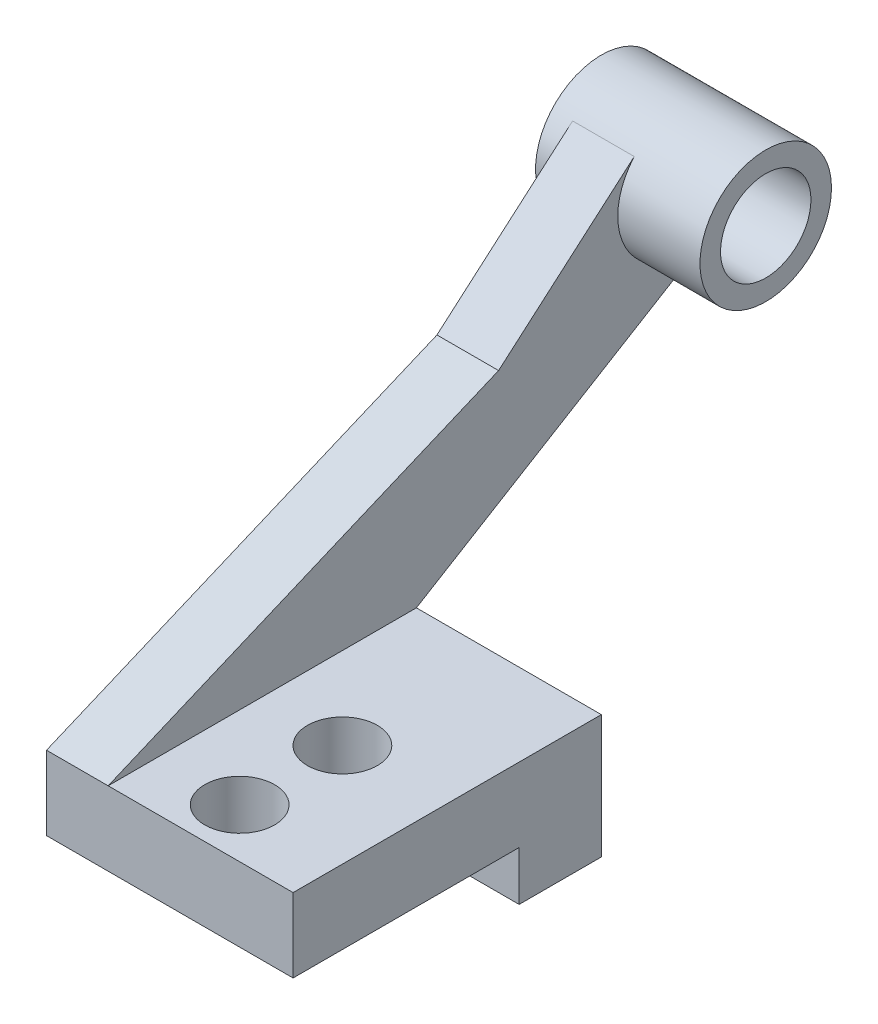
ISO-10303-21;
HEADER;
FILE_DESCRIPTION(('STEP AP214'),'2;1');
FILE_NAME('part.step','',(''),(''),'','','');
FILE_SCHEMA(('AUTOMOTIVE_DESIGN { 1 0 10303 214 1 1 1 1 }'));
ENDSEC;
DATA;
#1=APPLICATION_CONTEXT('core data for automotive mechanical design processes');
#2=APPLICATION_PROTOCOL_DEFINITION('international standard','automotive_design',2000,#1);
#3=PRODUCT_CONTEXT('',#1,'mechanical');
#4=PRODUCT('Part','Part','',(#3));
#5=PRODUCT_RELATED_PRODUCT_CATEGORY('part','',(#4));
#6=PRODUCT_DEFINITION_FORMATION('','',#4);
#7=PRODUCT_DEFINITION_CONTEXT('part definition',#1,'design');
#8=PRODUCT_DEFINITION('design','',#6,#7);
#9=PRODUCT_DEFINITION_SHAPE('','',#8);
#10=(LENGTH_UNIT() NAMED_UNIT(*) SI_UNIT(.MILLI.,.METRE.));
#11=(NAMED_UNIT(*) PLANE_ANGLE_UNIT() SI_UNIT($,.RADIAN.));
#12=(NAMED_UNIT(*) SI_UNIT($,.STERADIAN.) SOLID_ANGLE_UNIT());
#13=UNCERTAINTY_MEASURE_WITH_UNIT(LENGTH_MEASURE(1.E-05),#10,'distance_accuracy_value','');
#14=(GEOMETRIC_REPRESENTATION_CONTEXT(3) GLOBAL_UNCERTAINTY_ASSIGNED_CONTEXT((#13)) GLOBAL_UNIT_ASSIGNED_CONTEXT((#10,
#11,#12)) REPRESENTATION_CONTEXT('',''));
#15=CARTESIAN_POINT('',(0.,0.,0.));
#16=DIRECTION('',(0.,0.,1.));
#17=DIRECTION('',(1.,0.,0.));
#18=AXIS2_PLACEMENT_3D('',#15,#16,#17);
#19=CARTESIAN_POINT('',(0.,-10.4433547494815,-43.4293654089524));
#20=DIRECTION('',(0.,0.855666779720159,0.517527160720414));
#21=DIRECTION('',(0.,-0.517527160720414,0.855666779720159));
#22=AXIS2_PLACEMENT_3D('',#19,#20,#21);
#23=PLANE('',#22);
#24=DIRECTION('',(-1.,0.,0.));
#25=VECTOR('',#24,1.);
#26=CARTESIAN_POINT('',(35.,33.5737882804198,-116.206235663352));
#27=LINE('',#26,#25);
#28=CARTESIAN_POINT('',(15.,33.5737882804198,-116.206235663352));
#29=VERTEX_POINT('',#28);
#30=CARTESIAN_POINT('',(0.,33.5737882804198,-116.206235663352));
#31=VERTEX_POINT('',#30);
#32=EDGE_CURVE('E61',#29,#31,#27,.T.);
#33=ORIENTED_EDGE('',*,*,#32,.F.);
#34=DIRECTION('',(0.,-0.517527160720414,0.855666779720159));
#35=VECTOR('',#34,1.);
#36=CARTESIAN_POINT('',(15.,-10.4433547494815,-43.4293654089524));
#37=LINE('',#36,#35);
#38=CARTESIAN_POINT('',(15.,-10.4433547494815,-43.4293654089524));
#39=VERTEX_POINT('',#38);
#40=EDGE_CURVE('E129',#29,#39,#37,.T.);
#41=ORIENTED_EDGE('',*,*,#40,.T.);
#42=DIRECTION('',(1.,0.,0.));
#43=VECTOR('',#42,1.);
#44=CARTESIAN_POINT('',(0.,-10.4433547494815,-43.4293654089524));
#45=LINE('',#44,#43);
#46=CARTESIAN_POINT('',(0.,-10.4433547494815,-43.4293654089524));
#47=VERTEX_POINT('',#46);
#48=EDGE_CURVE('E142',#47,#39,#45,.T.);
#49=ORIENTED_EDGE('',*,*,#48,.F.);
#50=DIRECTION('',(0.,-0.517527160720414,0.855666779720159));
#51=VECTOR('',#50,1.);
#52=CARTESIAN_POINT('',(0.,-10.4433547494815,-43.4293654089524));
#53=LINE('',#52,#51);
#54=EDGE_CURVE('E123',#31,#47,#53,.T.);
#55=ORIENTED_EDGE('',*,*,#54,.F.);
#56=EDGE_LOOP('',(#33,#41,#49,#55));
#57=FACE_BOUND('',#56,.T.);
#58=ADVANCED_FACE('F37',(#57),#23,.F.);
#59=CARTESIAN_POINT('',(0.,29.5566452505185,-63.4293654089524));
#60=DIRECTION('',(0.,-0.755857888571638,-0.654735711783026));
#61=DIRECTION('',(0.,0.654735711783026,-0.755857888571638));
#62=AXIS2_PLACEMENT_3D('',#59,#60,#61);
#63=PLANE('',#62);
#64=DIRECTION('',(-1.,0.,0.));
#65=VECTOR('',#64,1.);
#66=CARTESIAN_POINT('',(35.,58.1485745198538,-96.4372415623022));
#67=LINE('',#66,#65);
#68=CARTESIAN_POINT('',(0.,58.1485745198538,-96.4372415623022));
#69=VERTEX_POINT('',#68);
#70=CARTESIAN_POINT('',(15.,58.1485745198538,-96.4372415623022));
#71=VERTEX_POINT('',#70);
#72=EDGE_CURVE('E12',#69,#71,#67,.F.);
#73=ORIENTED_EDGE('',*,*,#72,.F.);
#74=DIRECTION('',(0.,0.654735711783026,-0.755857888571638));
#75=VECTOR('',#74,1.);
#76=CARTESIAN_POINT('',(0.,29.5566452505185,-63.4293654089524));
#77=LINE('',#76,#75);
#78=CARTESIAN_POINT('',(0.,29.5566452505185,-63.4293654089524));
#79=VERTEX_POINT('',#78);
#80=EDGE_CURVE('E153',#79,#69,#77,.T.);
#81=ORIENTED_EDGE('',*,*,#80,.F.);
#82=DIRECTION('',(1.,0.,0.));
#83=VECTOR('',#82,1.);
#84=CARTESIAN_POINT('',(0.,29.5566452505185,-63.4293654089524));
#85=LINE('',#84,#83);
#86=CARTESIAN_POINT('',(15.,29.5566452505185,-63.4293654089524));
#87=VERTEX_POINT('',#86);
#88=EDGE_CURVE('E121',#79,#87,#85,.T.);
#89=ORIENTED_EDGE('',*,*,#88,.T.);
#90=DIRECTION('',(0.,0.654735711783026,-0.755857888571638));
#91=VECTOR('',#90,1.);
#92=CARTESIAN_POINT('',(15.,29.5566452505185,-63.4293654089524));
#93=LINE('',#92,#91);
#94=EDGE_CURVE('E117',#87,#71,#93,.T.);
#95=ORIENTED_EDGE('',*,*,#94,.T.);
#96=EDGE_LOOP('',(#73,#81,#89,#95));
#97=FACE_BOUND('',#96,.T.);
#98=ADVANCED_FACE('F119',(#97),#63,.F.);
#99=CARTESIAN_POINT('',(60.,-10.4433547494815,31.5706345910476));
#100=DIRECTION('',(0.,-1.,0.));
#101=DIRECTION('',(0.,0.,-1.));
#102=AXIS2_PLACEMENT_3D('',#99,#100,#101);
#103=PLANE('',#102);
#104=CARTESIAN_POINT('',(35.,-10.4433547494815,19.5706345910476));
#105=DIRECTION('',(0.,1.,0.));
#106=DIRECTION('',(0.,0.,1.));
#107=AXIS2_PLACEMENT_3D('',#104,#105,#106);
#108=CIRCLE('',#107,8.5);
#109=CARTESIAN_POINT('',(35.,-10.4433547494815,28.0706345910476));
#110=VERTEX_POINT('',#109);
#111=EDGE_CURVE('E333',#110,#110,#108,.T.);
#112=ORIENTED_EDGE('',*,*,#111,.F.);
#113=EDGE_LOOP('',(#112));
#114=FACE_BOUND('',#113,.T.);
#115=CARTESIAN_POINT('',(35.,-10.4433547494815,-5.42936540895244));
#116=DIRECTION('',(0.,1.,0.));
#117=DIRECTION('',(0.,0.,1.));
#118=AXIS2_PLACEMENT_3D('',#115,#116,#117);
#119=CIRCLE('',#118,8.5);
#120=CARTESIAN_POINT('',(35.,-10.4433547494815,3.07063459104756));
#121=VERTEX_POINT('',#120);
#122=EDGE_CURVE('E148',#121,#121,#119,.T.);
#123=ORIENTED_EDGE('',*,*,#122,.F.);
#124=EDGE_LOOP('',(#123));
#125=FACE_BOUND('',#124,.T.);
#126=DIRECTION('',(-1.,0.,0.));
#127=VECTOR('',#126,1.);
#128=CARTESIAN_POINT('',(60.,-10.4433547494815,-43.4293654089524));
#129=LINE('',#128,#127);
#130=CARTESIAN_POINT('',(60.,-10.4433547494815,-43.4293654089524));
#131=VERTEX_POINT('',#130);
#132=EDGE_CURVE('E293',#131,#39,#129,.T.);
#133=ORIENTED_EDGE('',*,*,#132,.T.);
#134=DIRECTION('',(0.,0.,1.));
#135=VECTOR('',#134,1.);
#136=CARTESIAN_POINT('',(15.,-10.4433547494815,31.5706345910476));
#137=LINE('',#136,#135);
#138=CARTESIAN_POINT('',(15.,-10.4433547494815,31.5706345910476));
#139=VERTEX_POINT('',#138);
#140=EDGE_CURVE('E136',#39,#139,#137,.T.);
#141=ORIENTED_EDGE('',*,*,#140,.T.);
#142=DIRECTION('',(-1.,0.,0.));
#143=VECTOR('',#142,1.);
#144=CARTESIAN_POINT('',(60.,-10.4433547494815,31.5706345910476));
#145=LINE('',#144,#143);
#146=CARTESIAN_POINT('',(60.,-10.4433547494815,31.5706345910476));
#147=VERTEX_POINT('',#146);
#148=EDGE_CURVE('E46',#147,#139,#145,.T.);
#149=ORIENTED_EDGE('',*,*,#148,.F.);
#150=DIRECTION('',(0.,0.,1.));
#151=VECTOR('',#150,1.);
#152=CARTESIAN_POINT('',(60.,-10.4433547494815,31.5706345910476));
#153=LINE('',#152,#151);
#154=EDGE_CURVE('E301',#131,#147,#153,.T.);
#155=ORIENTED_EDGE('',*,*,#154,.F.);
#156=EDGE_LOOP('',(#133,#141,#149,#155));
#157=FACE_BOUND('',#156,.T.);
#158=ADVANCED_FACE('F39',(#114,#125,#157),#103,.F.);
#159=CARTESIAN_POINT('',(60.,-10.4433547494815,31.5706345910476));
#160=DIRECTION('',(0.,0.,-1.));
#161=DIRECTION('',(-1.,0.,0.));
#162=AXIS2_PLACEMENT_3D('',#159,#160,#161);
#163=PLANE('',#162);
#164=DIRECTION('',(0.,-1.,0.));
#165=VECTOR('',#164,1.);
#166=CARTESIAN_POINT('',(0.,-10.4433547494815,31.5706345910476));
#167=LINE('',#166,#165);
#168=CARTESIAN_POINT('',(0.,-10.4433547494815,31.5706345910476));
#169=VERTEX_POINT('',#168);
#170=CARTESIAN_POINT('',(0.,-28.4433547494815,31.5706345910476));
#171=VERTEX_POINT('',#170);
#172=EDGE_CURVE('E261',#169,#171,#167,.T.);
#173=ORIENTED_EDGE('',*,*,#172,.T.);
#174=DIRECTION('',(-1.,0.,0.));
#175=VECTOR('',#174,1.);
#176=CARTESIAN_POINT('',(60.,-28.4433547494815,31.5706345910476));
#177=LINE('',#176,#175);
#178=CARTESIAN_POINT('',(60.,-28.4433547494815,31.5706345910476));
#179=VERTEX_POINT('',#178);
#180=EDGE_CURVE('E263',#179,#171,#177,.T.);
#181=ORIENTED_EDGE('',*,*,#180,.F.);
#182=DIRECTION('',(0.,-1.,0.));
#183=VECTOR('',#182,1.);
#184=CARTESIAN_POINT('',(60.,-10.4433547494815,31.5706345910476));
#185=LINE('',#184,#183);
#186=EDGE_CURVE('E309',#147,#179,#185,.T.);
#187=ORIENTED_EDGE('',*,*,#186,.F.);
#188=ORIENTED_EDGE('',*,*,#148,.T.);
#189=DIRECTION('',(1.,0.,0.));
#190=VECTOR('',#189,1.);
#191=CARTESIAN_POINT('',(0.,-10.4433547494815,31.5706345910476));
#192=LINE('',#191,#190);
#193=EDGE_CURVE('E139',#169,#139,#192,.T.);
#194=ORIENTED_EDGE('',*,*,#193,.F.);
#195=EDGE_LOOP('',(#173,#181,#187,#188,#194));
#196=FACE_BOUND('',#195,.T.);
#197=ADVANCED_FACE('F250',(#196),#163,.F.);
#198=CARTESIAN_POINT('',(60.,-28.4433547494815,-23.4293654089524));
#199=DIRECTION('',(0.,1.,0.));
#200=DIRECTION('',(0.,0.,1.));
#201=AXIS2_PLACEMENT_3D('',#198,#199,#200);
#202=PLANE('',#201);
#203=CARTESIAN_POINT('',(35.,-28.4433547494815,19.5706345910476));
#204=DIRECTION('',(0.,1.,0.));
#205=DIRECTION('',(0.,0.,1.));
#206=AXIS2_PLACEMENT_3D('',#203,#204,#205);
#207=CIRCLE('',#206,8.5);
#208=CARTESIAN_POINT('',(35.,-28.4433547494815,28.0706345910476));
#209=VERTEX_POINT('',#208);
#210=EDGE_CURVE('E268',#209,#209,#207,.T.);
#211=ORIENTED_EDGE('',*,*,#210,.T.);
#212=EDGE_LOOP('',(#211));
#213=FACE_BOUND('',#212,.T.);
#214=CARTESIAN_POINT('',(35.,-28.4433547494815,-5.42936540895244));
#215=DIRECTION('',(0.,1.,0.));
#216=DIRECTION('',(0.,0.,1.));
#217=AXIS2_PLACEMENT_3D('',#214,#215,#216);
#218=CIRCLE('',#217,8.5);
#219=CARTESIAN_POINT('',(35.,-28.4433547494815,3.07063459104756));
#220=VERTEX_POINT('',#219);
#221=EDGE_CURVE('E335',#220,#220,#218,.T.);
#222=ORIENTED_EDGE('',*,*,#221,.T.);
#223=EDGE_LOOP('',(#222));
#224=FACE_BOUND('',#223,.T.);
#225=DIRECTION('',(0.,0.,-1.));
#226=VECTOR('',#225,1.);
#227=CARTESIAN_POINT('',(0.,-28.4433547494815,-23.4293654089524));
#228=LINE('',#227,#226);
#229=CARTESIAN_POINT('',(0.,-28.4433547494815,-23.4293654089524));
#230=VERTEX_POINT('',#229);
#231=EDGE_CURVE('E267',#171,#230,#228,.T.);
#232=ORIENTED_EDGE('',*,*,#231,.T.);
#233=DIRECTION('',(-1.,0.,0.));
#234=VECTOR('',#233,1.);
#235=CARTESIAN_POINT('',(60.,-28.4433547494815,-23.4293654089524));
#236=LINE('',#235,#234);
#237=CARTESIAN_POINT('',(60.,-28.4433547494815,-23.4293654089524));
#238=VERTEX_POINT('',#237);
#239=EDGE_CURVE('E274',#238,#230,#236,.T.);
#240=ORIENTED_EDGE('',*,*,#239,.F.);
#241=DIRECTION('',(0.,0.,-1.));
#242=VECTOR('',#241,1.);
#243=CARTESIAN_POINT('',(60.,-28.4433547494815,-23.4293654089524));
#244=LINE('',#243,#242);
#245=EDGE_CURVE('E273',#179,#238,#244,.T.);
#246=ORIENTED_EDGE('',*,*,#245,.F.);
#247=ORIENTED_EDGE('',*,*,#180,.T.);
#248=EDGE_LOOP('',(#232,#240,#246,#247));
#249=FACE_BOUND('',#248,.T.);
#250=ADVANCED_FACE('F247',(#213,#224,#249),#202,.F.);
#251=CARTESIAN_POINT('',(60.,-40.4433547494815,-23.4293654089524));
#252=DIRECTION('',(0.,0.,-1.));
#253=DIRECTION('',(-1.,0.,0.));
#254=AXIS2_PLACEMENT_3D('',#251,#252,#253);
#255=PLANE('',#254);
#256=DIRECTION('',(0.,-1.,0.));
#257=VECTOR('',#256,1.);
#258=CARTESIAN_POINT('',(0.,-40.4433547494815,-23.4293654089524));
#259=LINE('',#258,#257);
#260=CARTESIAN_POINT('',(0.,-40.4433547494815,-23.4293654089524));
#261=VERTEX_POINT('',#260);
#262=EDGE_CURVE('E278',#230,#261,#259,.T.);
#263=ORIENTED_EDGE('',*,*,#262,.T.);
#264=DIRECTION('',(-1.,0.,0.));
#265=VECTOR('',#264,1.);
#266=CARTESIAN_POINT('',(60.,-40.4433547494815,-23.4293654089524));
#267=LINE('',#266,#265);
#268=CARTESIAN_POINT('',(60.,-40.4433547494815,-23.4293654089524));
#269=VERTEX_POINT('',#268);
#270=EDGE_CURVE('E328',#269,#261,#267,.T.);
#271=ORIENTED_EDGE('',*,*,#270,.F.);
#272=DIRECTION('',(0.,-1.,0.));
#273=VECTOR('',#272,1.);
#274=CARTESIAN_POINT('',(60.,-40.4433547494815,-23.4293654089524));
#275=LINE('',#274,#273);
#276=EDGE_CURVE('E318',#238,#269,#275,.T.);
#277=ORIENTED_EDGE('',*,*,#276,.F.);
#278=ORIENTED_EDGE('',*,*,#239,.T.);
#279=EDGE_LOOP('',(#263,#271,#277,#278));
#280=FACE_BOUND('',#279,.T.);
#281=ADVANCED_FACE('F243',(#280),#255,.F.);
#282=CARTESIAN_POINT('',(60.,-40.4433547494815,-43.4293654089524));
#283=DIRECTION('',(0.,1.,0.));
#284=DIRECTION('',(0.,0.,1.));
#285=AXIS2_PLACEMENT_3D('',#282,#283,#284);
#286=PLANE('',#285);
#287=DIRECTION('',(0.,0.,-1.));
#288=VECTOR('',#287,1.);
#289=CARTESIAN_POINT('',(0.,-40.4433547494815,-43.4293654089524));
#290=LINE('',#289,#288);
#291=CARTESIAN_POINT('',(0.,-40.4433547494815,-43.4293654089524));
#292=VERTEX_POINT('',#291);
#293=EDGE_CURVE('E280',#261,#292,#290,.T.);
#294=ORIENTED_EDGE('',*,*,#293,.T.);
#295=DIRECTION('',(-1.,0.,0.));
#296=VECTOR('',#295,1.);
#297=CARTESIAN_POINT('',(60.,-40.4433547494815,-43.4293654089524));
#298=LINE('',#297,#296);
#299=CARTESIAN_POINT('',(60.,-40.4433547494815,-43.4293654089524));
#300=VERTEX_POINT('',#299);
#301=EDGE_CURVE('E290',#300,#292,#298,.T.);
#302=ORIENTED_EDGE('',*,*,#301,.F.);
#303=DIRECTION('',(0.,0.,-1.));
#304=VECTOR('',#303,1.);
#305=CARTESIAN_POINT('',(60.,-40.4433547494815,-43.4293654089524));
#306=LINE('',#305,#304);
#307=EDGE_CURVE('E319',#269,#300,#306,.T.);
#308=ORIENTED_EDGE('',*,*,#307,.F.);
#309=ORIENTED_EDGE('',*,*,#270,.T.);
#310=EDGE_LOOP('',(#294,#302,#308,#309));
#311=FACE_BOUND('',#310,.T.);
#312=ADVANCED_FACE('F239',(#311),#286,.F.);
#313=CARTESIAN_POINT('',(60.,-10.4433547494815,-43.4293654089524));
#314=DIRECTION('',(0.,0.,1.));
#315=DIRECTION('',(0.,-1.,0.));
#316=AXIS2_PLACEMENT_3D('',#313,#314,#315);
#317=PLANE('',#316);
#318=DIRECTION('',(0.,1.,0.));
#319=VECTOR('',#318,1.);
#320=CARTESIAN_POINT('',(0.,-10.4433547494815,-43.4293654089524));
#321=LINE('',#320,#319);
#322=EDGE_CURVE('E287',#292,#47,#321,.T.);
#323=ORIENTED_EDGE('',*,*,#322,.T.);
#324=ORIENTED_EDGE('',*,*,#48,.T.);
#325=ORIENTED_EDGE('',*,*,#132,.F.);
#326=DIRECTION('',(0.,1.,0.));
#327=VECTOR('',#326,1.);
#328=CARTESIAN_POINT('',(60.,-10.4433547494815,-43.4293654089524));
#329=LINE('',#328,#327);
#330=EDGE_CURVE('E283',#300,#131,#329,.T.);
#331=ORIENTED_EDGE('',*,*,#330,.F.);
#332=ORIENTED_EDGE('',*,*,#301,.T.);
#333=EDGE_LOOP('',(#323,#324,#325,#331,#332));
#334=FACE_BOUND('',#333,.T.);
#335=ADVANCED_FACE('F233',(#334),#317,.F.);
#336=CARTESIAN_POINT('',(60.,0.,0.));
#337=DIRECTION('',(-1.,0.,0.));
#338=DIRECTION('',(0.,0.,1.));
#339=AXIS2_PLACEMENT_3D('',#336,#337,#338);
#340=PLANE('',#339);
#341=ORIENTED_EDGE('',*,*,#154,.T.);
#342=ORIENTED_EDGE('',*,*,#186,.T.);
#343=ORIENTED_EDGE('',*,*,#245,.T.);
#344=ORIENTED_EDGE('',*,*,#276,.T.);
#345=ORIENTED_EDGE('',*,*,#307,.T.);
#346=ORIENTED_EDGE('',*,*,#330,.T.);
#347=EDGE_LOOP('',(#341,#342,#343,#344,#345,#346));
#348=FACE_BOUND('',#347,.T.);
#349=ADVANCED_FACE('F230',(#348),#340,.F.);
#350=CARTESIAN_POINT('',(0.,0.,0.));
#351=DIRECTION('',(-1.,0.,0.));
#352=DIRECTION('',(0.,0.,1.));
#353=AXIS2_PLACEMENT_3D('',#350,#351,#352);
#354=PLANE('',#353);
#355=ORIENTED_EDGE('',*,*,#80,.T.);
#356=CARTESIAN_POINT('',(0.,47.5566452505185,-108.429365408952));
#357=DIRECTION('',(-1.,0.,0.));
#358=DIRECTION('',(0.,0.,1.));
#359=AXIS2_PLACEMENT_3D('',#356,#357,#358);
#360=CIRCLE('',#359,16.);
#361=EDGE_CURVE('E54',#69,#31,#360,.F.);
#362=ORIENTED_EDGE('',*,*,#361,.T.);
#363=ORIENTED_EDGE('',*,*,#54,.T.);
#364=ORIENTED_EDGE('',*,*,#322,.F.);
#365=ORIENTED_EDGE('',*,*,#293,.F.);
#366=ORIENTED_EDGE('',*,*,#262,.F.);
#367=ORIENTED_EDGE('',*,*,#231,.F.);
#368=ORIENTED_EDGE('',*,*,#172,.F.);
#369=DIRECTION('',(0.,0.388057000058133,-0.921635375138065));
#370=VECTOR('',#369,1.);
#371=CARTESIAN_POINT('',(0.,-10.4433547494815,31.5706345910476));
#372=LINE('',#371,#370);
#373=EDGE_CURVE('E145',#169,#79,#372,.T.);
#374=ORIENTED_EDGE('',*,*,#373,.T.);
#375=EDGE_LOOP('',(#355,#362,#363,#364,#365,#366,#367,#368,#374));
#376=FACE_BOUND('',#375,.T.);
#377=ADVANCED_FACE('F228',(#376),#354,.T.);
#378=CARTESIAN_POINT('',(35.,-70.4433547494815,-5.42936540895244));
#379=DIRECTION('',(0.,1.,0.));
#380=DIRECTION('',(0.,0.,1.));
#381=AXIS2_PLACEMENT_3D('',#378,#379,#380);
#382=CYLINDRICAL_SURFACE('',#381,8.5);
#383=ORIENTED_EDGE('',*,*,#122,.T.);
#384=EDGE_LOOP('',(#383));
#385=FACE_BOUND('',#384,.T.);
#386=ORIENTED_EDGE('',*,*,#221,.F.);
#387=EDGE_LOOP('',(#386));
#388=FACE_BOUND('',#387,.T.);
#389=ADVANCED_FACE('F224',(#385,#388),#382,.F.);
#390=CARTESIAN_POINT('',(35.,-70.4433547494815,19.5706345910476));
#391=DIRECTION('',(0.,1.,0.));
#392=DIRECTION('',(0.,0.,1.));
#393=AXIS2_PLACEMENT_3D('',#390,#391,#392);
#394=CYLINDRICAL_SURFACE('',#393,8.5);
#395=ORIENTED_EDGE('',*,*,#111,.T.);
#396=EDGE_LOOP('',(#395));
#397=FACE_BOUND('',#396,.T.);
#398=ORIENTED_EDGE('',*,*,#210,.F.);
#399=EDGE_LOOP('',(#398));
#400=FACE_BOUND('',#399,.T.);
#401=ADVANCED_FACE('F219',(#397,#400),#394,.F.);
#402=CARTESIAN_POINT('',(15.,0.,0.));
#403=DIRECTION('',(1.,0.,0.));
#404=DIRECTION('',(0.,0.,-1.));
#405=AXIS2_PLACEMENT_3D('',#402,#403,#404);
#406=PLANE('',#405);
#407=ORIENTED_EDGE('',*,*,#40,.F.);
#408=CARTESIAN_POINT('',(15.,47.5566452505185,-108.429365408952));
#409=DIRECTION('',(1.,0.,0.));
#410=DIRECTION('',(0.,0.,-1.));
#411=AXIS2_PLACEMENT_3D('',#408,#409,#410);
#412=CIRCLE('',#411,16.);
#413=EDGE_CURVE('E126',#29,#71,#412,.F.);
#414=ORIENTED_EDGE('',*,*,#413,.T.);
#415=ORIENTED_EDGE('',*,*,#94,.F.);
#416=DIRECTION('',(0.,0.388057000058133,-0.921635375138065));
#417=VECTOR('',#416,1.);
#418=CARTESIAN_POINT('',(15.,-10.4433547494815,31.5706345910476));
#419=LINE('',#418,#417);
#420=EDGE_CURVE('E149',#139,#87,#419,.T.);
#421=ORIENTED_EDGE('',*,*,#420,.F.);
#422=ORIENTED_EDGE('',*,*,#140,.F.);
#423=EDGE_LOOP('',(#407,#414,#415,#421,#422));
#424=FACE_BOUND('',#423,.T.);
#425=ADVANCED_FACE('F127',(#424),#406,.T.);
#426=CARTESIAN_POINT('',(0.,-10.4433547494815,31.5706345910476));
#427=DIRECTION('',(0.,-0.921635375138065,-0.388057000058133));
#428=DIRECTION('',(0.,0.388057000058133,-0.921635375138065));
#429=AXIS2_PLACEMENT_3D('',#426,#427,#428);
#430=PLANE('',#429);
#431=ORIENTED_EDGE('',*,*,#420,.T.);
#432=ORIENTED_EDGE('',*,*,#88,.F.);
#433=ORIENTED_EDGE('',*,*,#373,.F.);
#434=ORIENTED_EDGE('',*,*,#193,.T.);
#435=EDGE_LOOP('',(#431,#432,#433,#434));
#436=FACE_BOUND('',#435,.T.);
#437=ADVANCED_FACE('F215',(#436),#430,.F.);
#438=CARTESIAN_POINT('',(35.,47.5566452505185,-108.429365408952));
#439=DIRECTION('',(-1.,0.,0.));
#440=DIRECTION('',(0.,0.,1.));
#441=AXIS2_PLACEMENT_3D('',#438,#439,#440);
#442=CYLINDRICAL_SURFACE('',#441,16.);
#443=ORIENTED_EDGE('',*,*,#32,.T.);
#444=ORIENTED_EDGE('',*,*,#361,.F.);
#445=ORIENTED_EDGE('',*,*,#72,.T.);
#446=ORIENTED_EDGE('',*,*,#413,.F.);
#447=EDGE_LOOP('',(#443,#444,#445,#446));
#448=FACE_BOUND('',#447,.T.);
#449=CARTESIAN_POINT('',(35.,47.5566452505185,-108.429365408952));
#450=DIRECTION('',(1.,0.,0.));
#451=DIRECTION('',(0.,0.,-1.));
#452=AXIS2_PLACEMENT_3D('',#449,#450,#451);
#453=CIRCLE('',#452,16.);
#454=CARTESIAN_POINT('',(35.,47.5566452505185,-124.429365408952));
#455=VERTEX_POINT('',#454);
#456=EDGE_CURVE('E131',#455,#455,#453,.T.);
#457=ORIENTED_EDGE('',*,*,#456,.F.);
#458=EDGE_LOOP('',(#457));
#459=FACE_BOUND('',#458,.T.);
#460=CARTESIAN_POINT('',(-5.,47.5566452505185,-108.429365408952));
#461=DIRECTION('',(1.,0.,0.));
#462=DIRECTION('',(0.,0.,-1.));
#463=AXIS2_PLACEMENT_3D('',#460,#461,#462);
#464=CIRCLE('',#463,16.);
#465=CARTESIAN_POINT('',(-5.,47.5566452505185,-124.429365408952));
#466=VERTEX_POINT('',#465);
#467=EDGE_CURVE('E183',#466,#466,#464,.T.);
#468=ORIENTED_EDGE('',*,*,#467,.T.);
#469=EDGE_LOOP('',(#468));
#470=FACE_BOUND('',#469,.T.);
#471=ADVANCED_FACE('F133',(#448,#459,#470),#442,.T.);
#472=CARTESIAN_POINT('',(35.,47.5566452505185,-108.429365408952));
#473=DIRECTION('',(-1.,0.,0.));
#474=DIRECTION('',(0.,0.,1.));
#475=AXIS2_PLACEMENT_3D('',#472,#473,#474);
#476=CYLINDRICAL_SURFACE('',#475,11.);
#477=CARTESIAN_POINT('',(-5.,47.5566452505185,-108.429365408952));
#478=DIRECTION('',(1.,0.,0.));
#479=DIRECTION('',(0.,0.,-1.));
#480=AXIS2_PLACEMENT_3D('',#477,#478,#479);
#481=CIRCLE('',#480,11.);
#482=CARTESIAN_POINT('',(-5.,47.5566452505185,-119.429365408952));
#483=VERTEX_POINT('',#482);
#484=EDGE_CURVE('E186',#483,#483,#481,.T.);
#485=ORIENTED_EDGE('',*,*,#484,.F.);
#486=EDGE_LOOP('',(#485));
#487=FACE_BOUND('',#486,.T.);
#488=CARTESIAN_POINT('',(35.,47.5566452505185,-108.429365408952));
#489=DIRECTION('',(1.,0.,0.));
#490=DIRECTION('',(0.,0.,-1.));
#491=AXIS2_PLACEMENT_3D('',#488,#489,#490);
#492=CIRCLE('',#491,11.);
#493=CARTESIAN_POINT('',(35.,47.5566452505185,-119.429365408952));
#494=VERTEX_POINT('',#493);
#495=EDGE_CURVE('E180',#494,#494,#492,.T.);
#496=ORIENTED_EDGE('',*,*,#495,.T.);
#497=EDGE_LOOP('',(#496));
#498=FACE_BOUND('',#497,.T.);
#499=ADVANCED_FACE('F193',(#487,#498),#476,.F.);
#500=CARTESIAN_POINT('',(35.,47.5566452505185,-108.429365408952));
#501=DIRECTION('',(1.,0.,0.));
#502=DIRECTION('',(0.,0.,-1.));
#503=AXIS2_PLACEMENT_3D('',#500,#501,#502);
#504=PLANE('',#503);
#505=ORIENTED_EDGE('',*,*,#456,.T.);
#506=EDGE_LOOP('',(#505));
#507=FACE_BOUND('',#506,.T.);
#508=ORIENTED_EDGE('',*,*,#495,.F.);
#509=EDGE_LOOP('',(#508));
#510=FACE_BOUND('',#509,.T.);
#511=ADVANCED_FACE('F196',(#507,#510),#504,.T.);
#512=CARTESIAN_POINT('',(-5.,47.5566452505185,-108.429365408952));
#513=DIRECTION('',(1.,0.,0.));
#514=DIRECTION('',(0.,0.,-1.));
#515=AXIS2_PLACEMENT_3D('',#512,#513,#514);
#516=PLANE('',#515);
#517=ORIENTED_EDGE('',*,*,#484,.T.);
#518=EDGE_LOOP('',(#517));
#519=FACE_BOUND('',#518,.T.);
#520=ORIENTED_EDGE('',*,*,#467,.F.);
#521=EDGE_LOOP('',(#520));
#522=FACE_BOUND('',#521,.T.);
#523=ADVANCED_FACE('F190',(#519,#522),#516,.F.);
#524=CLOSED_SHELL('',(#58,#98,#158,#197,#250,#281,#312,#335,#349,#377,#389,#401,#425,#437,#471,
#499,#511,#523));
#525=MANIFOLD_SOLID_BREP('B2',#524);
#526=ADVANCED_BREP_SHAPE_REPRESENTATION('',(#18,#525),#14);
#527=SHAPE_DEFINITION_REPRESENTATION(#9,#526);
ENDSEC;
END-ISO-10303-21;
